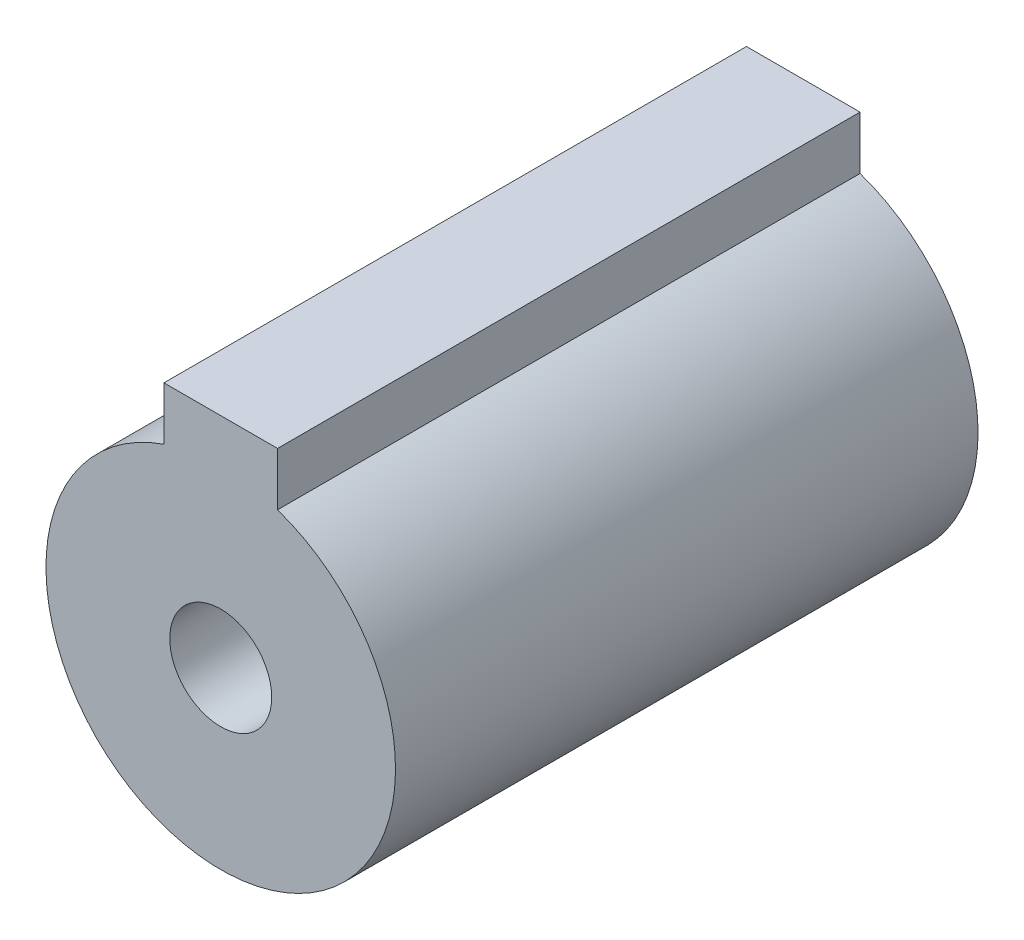
ISO-10303-21;
HEADER;
FILE_DESCRIPTION(('STEP AP214'),'2;1');
FILE_NAME('part.step','',(''),(''),'','','');
FILE_SCHEMA(('AUTOMOTIVE_DESIGN { 1 0 10303 214 1 1 1 1 }'));
ENDSEC;
DATA;
#1=APPLICATION_CONTEXT('core data for automotive mechanical design processes');
#2=APPLICATION_PROTOCOL_DEFINITION('international standard','automotive_design',2000,#1);
#3=PRODUCT_CONTEXT('',#1,'mechanical');
#4=PRODUCT('Part','Part','',(#3));
#5=PRODUCT_RELATED_PRODUCT_CATEGORY('part','',(#4));
#6=PRODUCT_DEFINITION_FORMATION('','',#4);
#7=PRODUCT_DEFINITION_CONTEXT('part definition',#1,'design');
#8=PRODUCT_DEFINITION('design','',#6,#7);
#9=PRODUCT_DEFINITION_SHAPE('','',#8);
#10=(LENGTH_UNIT() NAMED_UNIT(*) SI_UNIT(.MILLI.,.METRE.));
#11=(NAMED_UNIT(*) PLANE_ANGLE_UNIT() SI_UNIT($,.RADIAN.));
#12=(NAMED_UNIT(*) SI_UNIT($,.STERADIAN.) SOLID_ANGLE_UNIT());
#13=UNCERTAINTY_MEASURE_WITH_UNIT(LENGTH_MEASURE(1.E-05),#10,'distance_accuracy_value','');
#14=(GEOMETRIC_REPRESENTATION_CONTEXT(3) GLOBAL_UNCERTAINTY_ASSIGNED_CONTEXT((#13)) GLOBAL_UNIT_ASSIGNED_CONTEXT((#10,
#11,#12)) REPRESENTATION_CONTEXT('',''));
#15=CARTESIAN_POINT('',(0.,0.,0.));
#16=DIRECTION('',(0.,0.,1.));
#17=DIRECTION('',(1.,0.,0.));
#18=AXIS2_PLACEMENT_3D('',#15,#16,#17);
#19=CARTESIAN_POINT('',(0.,0.,0.));
#20=DIRECTION('',(0.,0.,1.));
#21=DIRECTION('',(1.,0.,0.));
#22=AXIS2_PLACEMENT_3D('',#19,#20,#21);
#23=PLANE('',#22);
#24=CARTESIAN_POINT('',(0.,0.,0.));
#25=DIRECTION('',(0.,0.,1.));
#26=DIRECTION('',(1.,0.,0.));
#27=AXIS2_PLACEMENT_3D('',#24,#25,#26);
#28=CIRCLE('',#27,12.);
#29=CARTESIAN_POINT('',(-3.9,11.3485681916266,0.));
#30=VERTEX_POINT('',#29);
#31=CARTESIAN_POINT('',(3.9,11.3485681916266,0.));
#32=VERTEX_POINT('',#31);
#33=EDGE_CURVE('E44',#30,#32,#28,.T.);
#34=ORIENTED_EDGE('',*,*,#33,.F.);
#35=DIRECTION('',(0.,-1.,0.));
#36=VECTOR('',#35,1.);
#37=CARTESIAN_POINT('',(-3.9,15.,0.));
#38=LINE('',#37,#36);
#39=CARTESIAN_POINT('',(-3.9,15.,0.));
#40=VERTEX_POINT('',#39);
#41=EDGE_CURVE('E138',#40,#30,#38,.T.);
#42=ORIENTED_EDGE('',*,*,#41,.F.);
#43=DIRECTION('',(-1.,0.,0.));
#44=VECTOR('',#43,1.);
#45=CARTESIAN_POINT('',(3.9,15.,0.));
#46=LINE('',#45,#44);
#47=CARTESIAN_POINT('',(3.9,15.,0.));
#48=VERTEX_POINT('',#47);
#49=EDGE_CURVE('E145',#48,#40,#46,.T.);
#50=ORIENTED_EDGE('',*,*,#49,.F.);
#51=DIRECTION('',(0.,1.,0.));
#52=VECTOR('',#51,1.);
#53=CARTESIAN_POINT('',(3.9,10.9481468651815,0.));
#54=LINE('',#53,#52);
#55=EDGE_CURVE('E132',#32,#48,#54,.T.);
#56=ORIENTED_EDGE('',*,*,#55,.F.);
#57=EDGE_LOOP('',(#34,#42,#50,#56));
#58=FACE_BOUND('',#57,.T.);
#59=DIRECTION('',(0.,1.,0.));
#60=VECTOR('',#59,1.);
#61=CARTESIAN_POINT('',(3.,8.35194350929281,0.));
#62=LINE('',#61,#60);
#63=CARTESIAN_POINT('',(3.,9.01387818865997,0.));
#64=VERTEX_POINT('',#63);
#65=CARTESIAN_POINT('',(3.,12.2,0.));
#66=VERTEX_POINT('',#65);
#67=EDGE_CURVE('E201',#64,#66,#62,.T.);
#68=ORIENTED_EDGE('',*,*,#67,.T.);
#69=DIRECTION('',(-1.,0.,0.));
#70=VECTOR('',#69,1.);
#71=CARTESIAN_POINT('',(3.,12.2,0.));
#72=LINE('',#71,#70);
#73=CARTESIAN_POINT('',(-3.,12.2,0.));
#74=VERTEX_POINT('',#73);
#75=EDGE_CURVE('E119',#66,#74,#72,.T.);
#76=ORIENTED_EDGE('',*,*,#75,.T.);
#77=DIRECTION('',(0.,-1.,0.));
#78=VECTOR('',#77,1.);
#79=CARTESIAN_POINT('',(-3.,12.2,0.));
#80=LINE('',#79,#78);
#81=CARTESIAN_POINT('',(-3.,9.01387818865997,0.));
#82=VERTEX_POINT('',#81);
#83=EDGE_CURVE('E109',#74,#82,#80,.T.);
#84=ORIENTED_EDGE('',*,*,#83,.T.);
#85=CARTESIAN_POINT('',(0.,0.,0.));
#86=DIRECTION('',(0.,0.,1.));
#87=DIRECTION('',(1.,0.,0.));
#88=AXIS2_PLACEMENT_3D('',#85,#86,#87);
#89=CIRCLE('',#88,9.5);
#90=EDGE_CURVE('E129',#82,#64,#89,.T.);
#91=ORIENTED_EDGE('',*,*,#90,.T.);
#92=EDGE_LOOP('',(#68,#76,#84,#91));
#93=FACE_BOUND('',#92,.T.);
#94=ADVANCED_FACE('F35',(#58,#93),#23,.F.);
#95=CARTESIAN_POINT('',(0.,0.,32.));
#96=DIRECTION('',(0.,0.,-1.));
#97=DIRECTION('',(-1.,0.,0.));
#98=AXIS2_PLACEMENT_3D('',#95,#96,#97);
#99=CYLINDRICAL_SURFACE('',#98,9.5);
#100=CARTESIAN_POINT('',(0.,0.,32.));
#101=DIRECTION('',(0.,0.,1.));
#102=DIRECTION('',(1.,0.,0.));
#103=AXIS2_PLACEMENT_3D('',#100,#101,#102);
#104=CIRCLE('',#103,9.5);
#105=CARTESIAN_POINT('',(-3.,9.01387818865997,32.));
#106=VERTEX_POINT('',#105);
#107=CARTESIAN_POINT('',(3.,9.01387818865997,32.));
#108=VERTEX_POINT('',#107);
#109=EDGE_CURVE('E130',#106,#108,#104,.T.);
#110=ORIENTED_EDGE('',*,*,#109,.T.);
#111=DIRECTION('',(0.,0.,-1.));
#112=VECTOR('',#111,1.);
#113=CARTESIAN_POINT('',(3.,9.01387818865997,32.));
#114=LINE('',#113,#112);
#115=EDGE_CURVE('E106',#108,#64,#114,.T.);
#116=ORIENTED_EDGE('',*,*,#115,.T.);
#117=ORIENTED_EDGE('',*,*,#90,.F.);
#118=DIRECTION('',(0.,0.,-1.));
#119=VECTOR('',#118,1.);
#120=CARTESIAN_POINT('',(-3.,9.01387818865997,32.));
#121=LINE('',#120,#119);
#122=EDGE_CURVE('E120',#82,#106,#121,.F.);
#123=ORIENTED_EDGE('',*,*,#122,.T.);
#124=EDGE_LOOP('',(#110,#116,#117,#123));
#125=FACE_BOUND('',#124,.T.);
#126=ADVANCED_FACE('F186',(#125),#99,.F.);
#127=CARTESIAN_POINT('',(0.,0.,40.));
#128=DIRECTION('',(0.,0.,-1.));
#129=DIRECTION('',(-1.,0.,0.));
#130=AXIS2_PLACEMENT_3D('',#127,#128,#129);
#131=CYLINDRICAL_SURFACE('',#130,12.);
#132=DIRECTION('',(0.,0.,-1.));
#133=VECTOR('',#132,1.);
#134=CARTESIAN_POINT('',(3.9,11.3485681916266,40.));
#135=LINE('',#134,#133);
#136=CARTESIAN_POINT('',(3.9,11.3485681916266,40.));
#137=VERTEX_POINT('',#136);
#138=EDGE_CURVE('E156',#137,#32,#135,.T.);
#139=ORIENTED_EDGE('',*,*,#138,.F.);
#140=CARTESIAN_POINT('',(0.,0.,40.));
#141=DIRECTION('',(0.,0.,1.));
#142=DIRECTION('',(1.,0.,0.));
#143=AXIS2_PLACEMENT_3D('',#140,#141,#142);
#144=CIRCLE('',#143,12.);
#145=CARTESIAN_POINT('',(-3.9,11.3485681916266,40.));
#146=VERTEX_POINT('',#145);
#147=EDGE_CURVE('E11',#146,#137,#144,.T.);
#148=ORIENTED_EDGE('',*,*,#147,.F.);
#149=DIRECTION('',(0.,0.,-1.));
#150=VECTOR('',#149,1.);
#151=CARTESIAN_POINT('',(-3.9,11.3485681916266,40.));
#152=LINE('',#151,#150);
#153=EDGE_CURVE('E154',#30,#146,#152,.F.);
#154=ORIENTED_EDGE('',*,*,#153,.F.);
#155=ORIENTED_EDGE('',*,*,#33,.T.);
#156=EDGE_LOOP('',(#139,#148,#154,#155));
#157=FACE_BOUND('',#156,.T.);
#158=ADVANCED_FACE('F37',(#157),#131,.T.);
#159=CARTESIAN_POINT('',(0.,0.,40.));
#160=DIRECTION('',(0.,0.,1.));
#161=DIRECTION('',(1.,0.,0.));
#162=AXIS2_PLACEMENT_3D('',#159,#160,#161);
#163=PLANE('',#162);
#164=CARTESIAN_POINT('',(0.,0.,40.));
#165=DIRECTION('',(0.,0.,1.));
#166=DIRECTION('',(1.,0.,0.));
#167=AXIS2_PLACEMENT_3D('',#164,#165,#166);
#168=CIRCLE('',#167,3.5);
#169=CARTESIAN_POINT('',(3.5,0.,40.));
#170=VERTEX_POINT('',#169);
#171=EDGE_CURVE('E199',#170,#170,#168,.F.);
#172=ORIENTED_EDGE('',*,*,#171,.T.);
#173=EDGE_LOOP('',(#172));
#174=FACE_BOUND('',#173,.T.);
#175=ORIENTED_EDGE('',*,*,#147,.T.);
#176=DIRECTION('',(0.,1.,0.));
#177=VECTOR('',#176,1.);
#178=CARTESIAN_POINT('',(3.9,10.9481468651815,40.));
#179=LINE('',#178,#177);
#180=CARTESIAN_POINT('',(3.9,15.,40.));
#181=VERTEX_POINT('',#180);
#182=EDGE_CURVE('E135',#137,#181,#179,.T.);
#183=ORIENTED_EDGE('',*,*,#182,.T.);
#184=DIRECTION('',(-1.,0.,0.));
#185=VECTOR('',#184,1.);
#186=CARTESIAN_POINT('',(3.9,15.,40.));
#187=LINE('',#186,#185);
#188=CARTESIAN_POINT('',(-3.9,15.,40.));
#189=VERTEX_POINT('',#188);
#190=EDGE_CURVE('E137',#181,#189,#187,.T.);
#191=ORIENTED_EDGE('',*,*,#190,.T.);
#192=DIRECTION('',(0.,-1.,0.));
#193=VECTOR('',#192,1.);
#194=CARTESIAN_POINT('',(-3.9,15.,40.));
#195=LINE('',#194,#193);
#196=EDGE_CURVE('E140',#189,#146,#195,.T.);
#197=ORIENTED_EDGE('',*,*,#196,.T.);
#198=EDGE_LOOP('',(#175,#183,#191,#197));
#199=FACE_BOUND('',#198,.T.);
#200=ADVANCED_FACE('F173',(#174,#199),#163,.T.);
#201=CARTESIAN_POINT('',(3.9,10.9481468651815,40.));
#202=DIRECTION('',(-1.,0.,0.));
#203=DIRECTION('',(0.,-1.,0.));
#204=AXIS2_PLACEMENT_3D('',#201,#202,#203);
#205=PLANE('',#204);
#206=ORIENTED_EDGE('',*,*,#182,.F.);
#207=ORIENTED_EDGE('',*,*,#138,.T.);
#208=ORIENTED_EDGE('',*,*,#55,.T.);
#209=DIRECTION('',(0.,0.,-1.));
#210=VECTOR('',#209,1.);
#211=CARTESIAN_POINT('',(3.9,15.,40.));
#212=LINE('',#211,#210);
#213=EDGE_CURVE('E151',#181,#48,#212,.T.);
#214=ORIENTED_EDGE('',*,*,#213,.F.);
#215=EDGE_LOOP('',(#206,#207,#208,#214));
#216=FACE_BOUND('',#215,.T.);
#217=ADVANCED_FACE('F163',(#216),#205,.F.);
#218=CARTESIAN_POINT('',(-3.9,15.,40.));
#219=DIRECTION('',(1.,0.,0.));
#220=DIRECTION('',(0.,1.,0.));
#221=AXIS2_PLACEMENT_3D('',#218,#219,#220);
#222=PLANE('',#221);
#223=ORIENTED_EDGE('',*,*,#41,.T.);
#224=ORIENTED_EDGE('',*,*,#153,.T.);
#225=ORIENTED_EDGE('',*,*,#196,.F.);
#226=DIRECTION('',(0.,0.,-1.));
#227=VECTOR('',#226,1.);
#228=CARTESIAN_POINT('',(-3.9,15.,40.));
#229=LINE('',#228,#227);
#230=EDGE_CURVE('E143',#189,#40,#229,.T.);
#231=ORIENTED_EDGE('',*,*,#230,.T.);
#232=EDGE_LOOP('',(#223,#224,#225,#231));
#233=FACE_BOUND('',#232,.T.);
#234=ADVANCED_FACE('F175',(#233),#222,.F.);
#235=CARTESIAN_POINT('',(3.9,15.,40.));
#236=DIRECTION('',(0.,-1.,0.));
#237=DIRECTION('',(1.,0.,0.));
#238=AXIS2_PLACEMENT_3D('',#235,#236,#237);
#239=PLANE('',#238);
#240=ORIENTED_EDGE('',*,*,#49,.T.);
#241=ORIENTED_EDGE('',*,*,#230,.F.);
#242=ORIENTED_EDGE('',*,*,#190,.F.);
#243=ORIENTED_EDGE('',*,*,#213,.T.);
#244=EDGE_LOOP('',(#240,#241,#242,#243));
#245=FACE_BOUND('',#244,.T.);
#246=ADVANCED_FACE('F170',(#245),#239,.F.);
#247=CARTESIAN_POINT('',(0.,0.,32.));
#248=DIRECTION('',(0.,0.,1.));
#249=DIRECTION('',(1.,0.,0.));
#250=AXIS2_PLACEMENT_3D('',#247,#248,#249);
#251=PLANE('',#250);
#252=CARTESIAN_POINT('',(0.,0.,32.));
#253=DIRECTION('',(0.,0.,1.));
#254=DIRECTION('',(1.,0.,0.));
#255=AXIS2_PLACEMENT_3D('',#252,#253,#254);
#256=CIRCLE('',#255,3.5);
#257=CARTESIAN_POINT('',(3.5,0.,32.));
#258=VERTEX_POINT('',#257);
#259=EDGE_CURVE('E39',#258,#258,#256,.F.);
#260=ORIENTED_EDGE('',*,*,#259,.F.);
#261=EDGE_LOOP('',(#260));
#262=FACE_BOUND('',#261,.T.);
#263=ORIENTED_EDGE('',*,*,#109,.F.);
#264=DIRECTION('',(0.,-1.,0.));
#265=VECTOR('',#264,1.);
#266=CARTESIAN_POINT('',(-3.,12.2,32.));
#267=LINE('',#266,#265);
#268=CARTESIAN_POINT('',(-3.,12.2,32.));
#269=VERTEX_POINT('',#268);
#270=EDGE_CURVE('E113',#269,#106,#267,.T.);
#271=ORIENTED_EDGE('',*,*,#270,.F.);
#272=DIRECTION('',(-1.,0.,0.));
#273=VECTOR('',#272,1.);
#274=CARTESIAN_POINT('',(3.,12.2,32.));
#275=LINE('',#274,#273);
#276=CARTESIAN_POINT('',(3.,12.2,32.));
#277=VERTEX_POINT('',#276);
#278=EDGE_CURVE('E108',#277,#269,#275,.T.);
#279=ORIENTED_EDGE('',*,*,#278,.F.);
#280=DIRECTION('',(0.,1.,0.));
#281=VECTOR('',#280,1.);
#282=CARTESIAN_POINT('',(3.,8.35194350929281,32.));
#283=LINE('',#282,#281);
#284=EDGE_CURVE('E52',#108,#277,#283,.T.);
#285=ORIENTED_EDGE('',*,*,#284,.F.);
#286=EDGE_LOOP('',(#263,#271,#279,#285));
#287=FACE_BOUND('',#286,.T.);
#288=ADVANCED_FACE('F112',(#262,#287),#251,.F.);
#289=CARTESIAN_POINT('',(3.,8.35194350929281,32.));
#290=DIRECTION('',(-1.,0.,0.));
#291=DIRECTION('',(0.,-1.,0.));
#292=AXIS2_PLACEMENT_3D('',#289,#290,#291);
#293=PLANE('',#292);
#294=ORIENTED_EDGE('',*,*,#284,.T.);
#295=DIRECTION('',(0.,0.,-1.));
#296=VECTOR('',#295,1.);
#297=CARTESIAN_POINT('',(3.,12.2,32.));
#298=LINE('',#297,#296);
#299=EDGE_CURVE('E103',#277,#66,#298,.T.);
#300=ORIENTED_EDGE('',*,*,#299,.T.);
#301=ORIENTED_EDGE('',*,*,#67,.F.);
#302=ORIENTED_EDGE('',*,*,#115,.F.);
#303=EDGE_LOOP('',(#294,#300,#301,#302));
#304=FACE_BOUND('',#303,.T.);
#305=ADVANCED_FACE('F101',(#304),#293,.T.);
#306=CARTESIAN_POINT('',(3.,12.2,32.));
#307=DIRECTION('',(0.,-1.,0.));
#308=DIRECTION('',(0.,0.,-1.));
#309=AXIS2_PLACEMENT_3D('',#306,#307,#308);
#310=PLANE('',#309);
#311=ORIENTED_EDGE('',*,*,#75,.F.);
#312=ORIENTED_EDGE('',*,*,#299,.F.);
#313=ORIENTED_EDGE('',*,*,#278,.T.);
#314=DIRECTION('',(0.,0.,-1.));
#315=VECTOR('',#314,1.);
#316=CARTESIAN_POINT('',(-3.,12.2,32.));
#317=LINE('',#316,#315);
#318=EDGE_CURVE('E121',#269,#74,#317,.T.);
#319=ORIENTED_EDGE('',*,*,#318,.T.);
#320=EDGE_LOOP('',(#311,#312,#313,#319));
#321=FACE_BOUND('',#320,.T.);
#322=ADVANCED_FACE('F117',(#321),#310,.T.);
#323=CARTESIAN_POINT('',(-3.,12.2,32.));
#324=DIRECTION('',(1.,0.,0.));
#325=DIRECTION('',(0.,1.,0.));
#326=AXIS2_PLACEMENT_3D('',#323,#324,#325);
#327=PLANE('',#326);
#328=ORIENTED_EDGE('',*,*,#83,.F.);
#329=ORIENTED_EDGE('',*,*,#318,.F.);
#330=ORIENTED_EDGE('',*,*,#270,.T.);
#331=ORIENTED_EDGE('',*,*,#122,.F.);
#332=EDGE_LOOP('',(#328,#329,#330,#331));
#333=FACE_BOUND('',#332,.T.);
#334=ADVANCED_FACE('F211',(#333),#327,.T.);
#335=CARTESIAN_POINT('',(0.,0.,42.));
#336=DIRECTION('',(0.,0.,-1.));
#337=DIRECTION('',(-1.,0.,0.));
#338=AXIS2_PLACEMENT_3D('',#335,#336,#337);
#339=CYLINDRICAL_SURFACE('',#338,3.5);
#340=ORIENTED_EDGE('',*,*,#171,.F.);
#341=EDGE_LOOP('',(#340));
#342=FACE_BOUND('',#341,.T.);
#343=ORIENTED_EDGE('',*,*,#259,.T.);
#344=EDGE_LOOP('',(#343));
#345=FACE_BOUND('',#344,.T.);
#346=ADVANCED_FACE('F213',(#342,#345),#339,.F.);
#347=CLOSED_SHELL('',(#94,#126,#158,#200,#217,#234,#246,#288,#305,#322,#334,#346));
#348=MANIFOLD_SOLID_BREP('B2',#347);
#349=ADVANCED_BREP_SHAPE_REPRESENTATION('',(#18,#348),#14);
#350=SHAPE_DEFINITION_REPRESENTATION(#9,#349);
ENDSEC;
END-ISO-10303-21;
